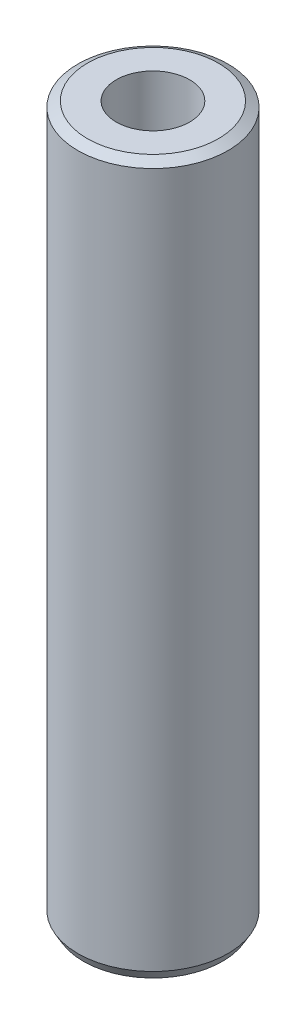
ISO-10303-21;
HEADER;
FILE_DESCRIPTION(('STEP AP214'),'2;1');
FILE_NAME('part.step','',(''),(''),'','','');
FILE_SCHEMA(('AUTOMOTIVE_DESIGN { 1 0 10303 214 1 1 1 1 }'));
ENDSEC;
DATA;
#1=APPLICATION_CONTEXT('core data for automotive mechanical design processes');
#2=APPLICATION_PROTOCOL_DEFINITION('international standard','automotive_design',2000,#1);
#3=PRODUCT_CONTEXT('',#1,'mechanical');
#4=PRODUCT('Part','Part','',(#3));
#5=PRODUCT_RELATED_PRODUCT_CATEGORY('part','',(#4));
#6=PRODUCT_DEFINITION_FORMATION('','',#4);
#7=PRODUCT_DEFINITION_CONTEXT('part definition',#1,'design');
#8=PRODUCT_DEFINITION('design','',#6,#7);
#9=PRODUCT_DEFINITION_SHAPE('','',#8);
#10=(LENGTH_UNIT() NAMED_UNIT(*) SI_UNIT(.MILLI.,.METRE.));
#11=(NAMED_UNIT(*) PLANE_ANGLE_UNIT() SI_UNIT($,.RADIAN.));
#12=(NAMED_UNIT(*) SI_UNIT($,.STERADIAN.) SOLID_ANGLE_UNIT());
#13=UNCERTAINTY_MEASURE_WITH_UNIT(LENGTH_MEASURE(1.E-05),#10,'distance_accuracy_value','');
#14=(GEOMETRIC_REPRESENTATION_CONTEXT(3) GLOBAL_UNCERTAINTY_ASSIGNED_CONTEXT((#13)) GLOBAL_UNIT_ASSIGNED_CONTEXT((#10,
#11,#12)) REPRESENTATION_CONTEXT('',''));
#15=CARTESIAN_POINT('',(0.,0.,0.));
#16=DIRECTION('',(0.,0.,1.));
#17=DIRECTION('',(1.,0.,0.));
#18=AXIS2_PLACEMENT_3D('',#15,#16,#17);
#19=CARTESIAN_POINT('',(0.,449.503892618058,0.));
#20=DIRECTION('',(0.,-1.,0.));
#21=DIRECTION('',(0.,0.,-1.));
#22=AXIS2_PLACEMENT_3D('',#19,#20,#21);
#23=CYLINDRICAL_SURFACE('',#22,47.5);
#24=CARTESIAN_POINT('',(0.,446.008487676846,0.));
#25=DIRECTION('',(0.,1.,0.));
#26=DIRECTION('',(0.,0.,1.));
#27=AXIS2_PLACEMENT_3D('',#24,#25,#26);
#28=CIRCLE('',#27,47.5);
#29=CARTESIAN_POINT('',(0.,446.008487676846,47.5));
#30=VERTEX_POINT('',#29);
#31=EDGE_CURVE('E50',#30,#30,#28,.F.);
#32=ORIENTED_EDGE('',*,*,#31,.T.);
#33=EDGE_LOOP('',(#32));
#34=FACE_BOUND('',#33,.T.);
#35=CARTESIAN_POINT('',(0.,6.05421895120623,0.));
#36=DIRECTION('',(0.,1.,0.));
#37=DIRECTION('',(0.,0.,1.));
#38=AXIS2_PLACEMENT_3D('',#35,#36,#37);
#39=CIRCLE('',#38,47.5);
#40=CARTESIAN_POINT('',(0.,6.05421895120623,47.5));
#41=VERTEX_POINT('',#40);
#42=EDGE_CURVE('E51',#41,#41,#39,.T.);
#43=ORIENTED_EDGE('',*,*,#42,.T.);
#44=EDGE_LOOP('',(#43));
#45=FACE_BOUND('',#44,.T.);
#46=ADVANCED_FACE('F39',(#34,#45),#23,.T.);
#47=CARTESIAN_POINT('',(0.,449.503892618058,0.));
#48=DIRECTION('',(0.,1.,0.));
#49=DIRECTION('',(0.,0.,1.));
#50=AXIS2_PLACEMENT_3D('',#47,#48,#49);
#51=PLANE('',#50);
#52=CARTESIAN_POINT('',(0.,449.503892618058,0.));
#53=DIRECTION('',(0.,1.,0.));
#54=DIRECTION('',(0.,0.,1.));
#55=AXIS2_PLACEMENT_3D('',#52,#53,#54);
#56=CIRCLE('',#55,41.445781048794);
#57=CARTESIAN_POINT('',(0.,449.503892618058,41.445781048794));
#58=VERTEX_POINT('',#57);
#59=EDGE_CURVE('E54',#58,#58,#56,.T.);
#60=ORIENTED_EDGE('',*,*,#59,.T.);
#61=EDGE_LOOP('',(#60));
#62=FACE_BOUND('',#61,.T.);
#63=CARTESIAN_POINT('',(0.,449.503892618058,0.));
#64=DIRECTION('',(0.,1.,0.));
#65=DIRECTION('',(0.,0.,1.));
#66=AXIS2_PLACEMENT_3D('',#63,#64,#65);
#67=CIRCLE('',#66,23.2236944333733);
#68=CARTESIAN_POINT('',(0.,449.503892618058,23.2236944333733));
#69=VERTEX_POINT('',#68);
#70=EDGE_CURVE('E58',#69,#69,#67,.T.);
#71=ORIENTED_EDGE('',*,*,#70,.F.);
#72=EDGE_LOOP('',(#71));
#73=FACE_BOUND('',#72,.T.);
#74=ADVANCED_FACE('F69',(#62,#73),#51,.T.);
#75=CARTESIAN_POINT('',(0.,0.,0.));
#76=DIRECTION('',(0.,1.,0.));
#77=DIRECTION('',(0.,0.,1.));
#78=AXIS2_PLACEMENT_3D('',#75,#76,#77);
#79=PLANE('',#78);
#80=CARTESIAN_POINT('',(0.,0.,0.));
#81=DIRECTION('',(0.,1.,0.));
#82=DIRECTION('',(0.,0.,1.));
#83=AXIS2_PLACEMENT_3D('',#80,#81,#82);
#84=CIRCLE('',#83,44.0045950587881);
#85=CARTESIAN_POINT('',(0.,0.,44.0045950587881));
#86=VERTEX_POINT('',#85);
#87=EDGE_CURVE('E10',#86,#86,#84,.F.);
#88=ORIENTED_EDGE('',*,*,#87,.T.);
#89=EDGE_LOOP('',(#88));
#90=FACE_BOUND('',#89,.T.);
#91=CARTESIAN_POINT('',(0.,0.,0.));
#92=DIRECTION('',(0.,1.,0.));
#93=DIRECTION('',(0.,0.,1.));
#94=AXIS2_PLACEMENT_3D('',#91,#92,#93);
#95=CIRCLE('',#94,23.2236944333733);
#96=CARTESIAN_POINT('',(0.,0.,23.2236944333733));
#97=VERTEX_POINT('',#96);
#98=EDGE_CURVE('E63',#97,#97,#95,.T.);
#99=ORIENTED_EDGE('',*,*,#98,.T.);
#100=EDGE_LOOP('',(#99));
#101=FACE_BOUND('',#100,.T.);
#102=ADVANCED_FACE('F75',(#90,#101),#79,.F.);
#103=CARTESIAN_POINT('',(0.,449.503892618058,0.));
#104=DIRECTION('',(0.,-1.,0.));
#105=DIRECTION('',(0.,0.,-1.));
#106=AXIS2_PLACEMENT_3D('',#103,#104,#105);
#107=CYLINDRICAL_SURFACE('',#106,23.2236944333733);
#108=ORIENTED_EDGE('',*,*,#70,.T.);
#109=EDGE_LOOP('',(#108));
#110=FACE_BOUND('',#109,.T.);
#111=ORIENTED_EDGE('',*,*,#98,.F.);
#112=EDGE_LOOP('',(#111));
#113=FACE_BOUND('',#112,.T.);
#114=ADVANCED_FACE('F70',(#110,#113),#107,.F.);
#115=CARTESIAN_POINT('',(0.,449.503892618058,0.));
#116=DIRECTION('',(0.,-1.,0.));
#117=DIRECTION('',(0.,0.,-1.));
#118=AXIS2_PLACEMENT_3D('',#115,#116,#117);
#119=CONICAL_SURFACE('',#118,41.445781048794,1.0471975511966);
#120=ORIENTED_EDGE('',*,*,#31,.F.);
#121=EDGE_LOOP('',(#120));
#122=FACE_BOUND('',#121,.T.);
#123=ORIENTED_EDGE('',*,*,#59,.F.);
#124=EDGE_LOOP('',(#123));
#125=FACE_BOUND('',#124,.T.);
#126=ADVANCED_FACE('F81',(#122,#125),#119,.T.);
#127=CARTESIAN_POINT('',(0.,6.05421895120623,0.));
#128=DIRECTION('',(0.,1.,0.));
#129=DIRECTION('',(0.,0.,1.));
#130=AXIS2_PLACEMENT_3D('',#127,#128,#129);
#131=CONICAL_SURFACE('',#130,47.5,0.5235987755983);
#132=CARTESIAN_POINT('',(0.,0.,44.0045950587881));
#133=CARTESIAN_POINT('',(0.,0.0630647807417293,44.0410055269258));
#134=CARTESIAN_POINT('',(0.,0.126129561483461,44.0774159950634));
#135=CARTESIAN_POINT('',(0.,0.252259122966925,44.1502369313386));
#136=CARTESIAN_POINT('',(0.,0.315323903708657,44.1866473994763));
#137=CARTESIAN_POINT('',(0.,0.44145346519212,44.2594683357515));
#138=CARTESIAN_POINT('',(0.,0.504518245933852,44.2958788038891));
#139=CARTESIAN_POINT('',(0.,0.630647807417314,44.3686997401644));
#140=CARTESIAN_POINT('',(0.,0.693712588159045,44.405110208302));
#141=CARTESIAN_POINT('',(0.,0.819842149642508,44.4779311445772));
#142=CARTESIAN_POINT('',(0.,0.882906930384241,44.5143416127149));
#143=CARTESIAN_POINT('',(0.,1.0090364918677,44.5871625489901));
#144=CARTESIAN_POINT('',(0.,1.07210127260943,44.6235730171277));
#145=CARTESIAN_POINT('',(0.,1.1982308340929,44.696393953403));
#146=CARTESIAN_POINT('',(0.,1.26129561483463,44.7328044215406));
#147=CARTESIAN_POINT('',(0.,1.38742517631809,44.8056253578159));
#148=CARTESIAN_POINT('',(0.,1.45048995705982,44.8420358259535));
#149=CARTESIAN_POINT('',(0.,1.57661951854329,44.9148567622287));
#150=CARTESIAN_POINT('',(0.,1.63968429928502,44.9512672303664));
#151=CARTESIAN_POINT('',(0.,1.76581386076848,45.0240881666416));
#152=CARTESIAN_POINT('',(0.,1.82887864151021,45.0604986347792));
#153=CARTESIAN_POINT('',(0.,1.95500820299368,45.1333195710545));
#154=CARTESIAN_POINT('',(0.,2.01807298373541,45.1697300391921));
#155=CARTESIAN_POINT('',(0.,2.14420254521887,45.2425509754674));
#156=CARTESIAN_POINT('',(0.,2.2072673259606,45.278961443605));
#157=CARTESIAN_POINT('',(0.,2.33339688744406,45.3517823798802));
#158=CARTESIAN_POINT('',(0.,2.3964616681858,45.3881928480178));
#159=CARTESIAN_POINT('',(0.,2.52259122966926,45.4610137842931));
#160=CARTESIAN_POINT('',(0.,2.58565601041099,45.4974242524307));
#161=CARTESIAN_POINT('',(0.,2.71178557189445,45.570245188706));
#162=CARTESIAN_POINT('',(0.,2.77485035263618,45.6066556568436));
#163=CARTESIAN_POINT('',(0.,2.90097991411965,45.6794765931188));
#164=CARTESIAN_POINT('',(0.,2.96404469486138,45.7158870612565));
#165=CARTESIAN_POINT('',(0.,3.09017425634484,45.7887079975317));
#166=CARTESIAN_POINT('',(0.,3.15323903708658,45.8251184656693));
#167=CARTESIAN_POINT('',(0.,3.27936859857004,45.8979394019446));
#168=CARTESIAN_POINT('',(0.,3.34243337931177,45.9343498700822));
#169=CARTESIAN_POINT('',(0.,3.46856294079523,46.0071708063574));
#170=CARTESIAN_POINT('',(0.,3.53162772153696,46.0435812744951));
#171=CARTESIAN_POINT('',(0.,3.65775728302043,46.1164022107703));
#172=CARTESIAN_POINT('',(0.,3.72082206376216,46.1528126789079));
#173=CARTESIAN_POINT('',(0.,3.84695162524562,46.2256336151832));
#174=CARTESIAN_POINT('',(0.,3.91001640598735,46.2620440833208));
#175=CARTESIAN_POINT('',(0.,4.03614596747082,46.3348650195961));
#176=CARTESIAN_POINT('',(0.,4.09921074821255,46.3712754877337));
#177=CARTESIAN_POINT('',(0.,4.22534030969601,46.4440964240089));
#178=CARTESIAN_POINT('',(0.,4.28840509043774,46.4805068921466));
#179=CARTESIAN_POINT('',(0.,4.41453465192121,46.5533278284218));
#180=CARTESIAN_POINT('',(0.,4.47759943266294,46.5897382965594));
#181=CARTESIAN_POINT('',(0.,4.6037289941464,46.6625592328347));
#182=CARTESIAN_POINT('',(0.,4.66679377488813,46.6989697009723));
#183=CARTESIAN_POINT('',(0.,4.79292333637159,46.7717906372475));
#184=CARTESIAN_POINT('',(0.,4.85598811711333,46.8082011053852));
#185=CARTESIAN_POINT('',(0.,4.98211767859679,46.8810220416604));
#186=CARTESIAN_POINT('',(0.,5.04518245933852,46.917432509798));
#187=CARTESIAN_POINT('',(0.,5.17131202082198,46.9902534460733));
#188=CARTESIAN_POINT('',(0.,5.23437680156372,47.0266639142109));
#189=CARTESIAN_POINT('',(0.,5.36050636304718,47.0994848504861));
#190=CARTESIAN_POINT('',(0.,5.42357114378891,47.1358953186238));
#191=CARTESIAN_POINT('',(0.,5.54970070527237,47.208716254899));
#192=CARTESIAN_POINT('',(0.,5.6127654860141,47.2451267230366));
#193=CARTESIAN_POINT('',(0.,5.73889504749757,47.3179476593119));
#194=CARTESIAN_POINT('',(0.,5.8019598282393,47.3543581274495));
#195=CARTESIAN_POINT('',(0.,5.92808938972276,47.4271790637248));
#196=CARTESIAN_POINT('',(0.,5.99115417046449,47.4635895318624));
#197=CARTESIAN_POINT('',(0.,6.05421895120623,47.5));
#198=B_SPLINE_CURVE_WITH_KNOTS('',3,(#132,#133,#134,#135,#136,#137,#138,#139,#140,#141,#142,
#143,#144,#145,#146,#147,#148,#149,#150,#151,#152,#153,#154,#155,#156,#157,#158,#159,#160,#161,
#162,#163,#164,#165,#166,#167,#168,#169,#170,#171,#172,#173,#174,#175,#176,#177,#178,#179,#180,
#181,#182,#183,#184,#185,#186,#187,#188,#189,#190,#191,#192,#193,#194,#195,#196,#197),
.UNSPECIFIED.,.F.,.F.,(4,2,2,2,2,2,2,2,2,2,2,2,2,2,2,2,2,2,2,2,2,2,2,2,2,2,2,2,2,2,2,2,4),(0.,
0.218462808825742,0.43692561765148,0.655388426477221,0.873851235302963,1.0923140441287,
1.31077685295444,1.52923966178018,1.74770247060593,1.96616527943166,2.18462808825741,
2.40309089708315,2.62155370590889,2.84001651473463,3.05847932356037,3.27694213238611,
3.49540494121185,3.71386775003759,3.93233055886333,4.15079336768907,4.36925617651481,
4.58771898534055,4.80618179416629,5.02464460299203,5.24310741181777,5.46157022064352,
5.68003302946926,5.898495838295,6.11695864712074,6.33542145594648,6.55388426477222,
6.77234707359796,6.9908098824237),.UNSPECIFIED.);
#199=EDGE_CURVE('BSEAM45',#86,#41,#198,.T.);
#200=ORIENTED_EDGE('',*,*,#87,.F.);
#201=ORIENTED_EDGE('',*,*,#42,.F.);
#202=ORIENTED_EDGE('',*,*,#199,.T.);
#203=ORIENTED_EDGE('',*,*,#199,.F.);
#204=EDGE_LOOP('',(#200,#202,#201,#203));
#205=FACE_BOUND('',#204,.T.);
#206=ADVANCED_FACE('F45',(#205),#131,.T.);
#207=CLOSED_SHELL('',(#46,#74,#102,#114,#126,#206));
#208=MANIFOLD_SOLID_BREP('B2',#207);
#209=ADVANCED_BREP_SHAPE_REPRESENTATION('',(#18,#208),#14);
#210=SHAPE_DEFINITION_REPRESENTATION(#9,#209);
ENDSEC;
END-ISO-10303-21;
